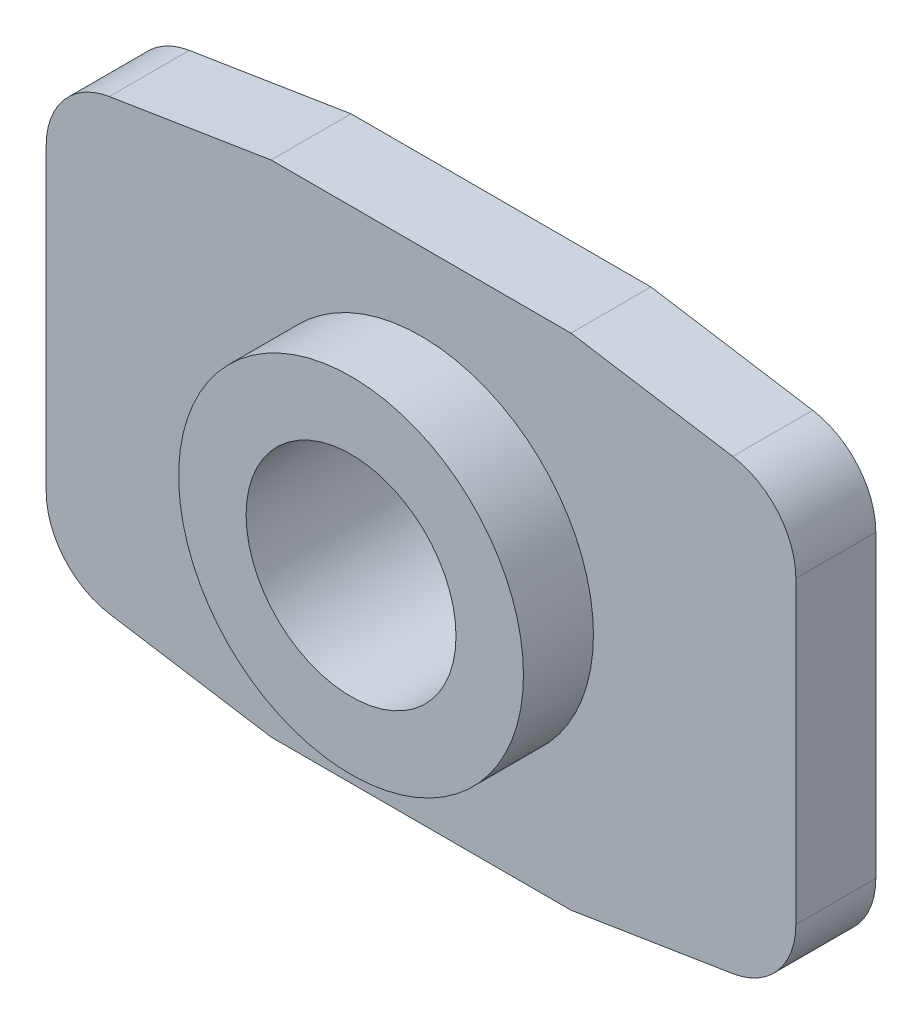
ISO-10303-21;
HEADER;
FILE_DESCRIPTION(('STEP AP214'),'2;1');
FILE_NAME('part.step','',(''),(''),'','','');
FILE_SCHEMA(('AUTOMOTIVE_DESIGN { 1 0 10303 214 1 1 1 1 }'));
ENDSEC;
DATA;
#1=APPLICATION_CONTEXT('core data for automotive mechanical design processes');
#2=APPLICATION_PROTOCOL_DEFINITION('international standard','automotive_design',2000,#1);
#3=PRODUCT_CONTEXT('',#1,'mechanical');
#4=PRODUCT('Part','Part','',(#3));
#5=PRODUCT_RELATED_PRODUCT_CATEGORY('part','',(#4));
#6=PRODUCT_DEFINITION_FORMATION('','',#4);
#7=PRODUCT_DEFINITION_CONTEXT('part definition',#1,'design');
#8=PRODUCT_DEFINITION('design','',#6,#7);
#9=PRODUCT_DEFINITION_SHAPE('','',#8);
#10=(LENGTH_UNIT() NAMED_UNIT(*) SI_UNIT(.MILLI.,.METRE.));
#11=(NAMED_UNIT(*) PLANE_ANGLE_UNIT() SI_UNIT($,.RADIAN.));
#12=(NAMED_UNIT(*) SI_UNIT($,.STERADIAN.) SOLID_ANGLE_UNIT());
#13=UNCERTAINTY_MEASURE_WITH_UNIT(LENGTH_MEASURE(1.E-05),#10,'distance_accuracy_value','');
#14=(GEOMETRIC_REPRESENTATION_CONTEXT(3) GLOBAL_UNCERTAINTY_ASSIGNED_CONTEXT((#13)) GLOBAL_UNIT_ASSIGNED_CONTEXT((#10,
#11,#12)) REPRESENTATION_CONTEXT('',''));
#15=CARTESIAN_POINT('',(0.,0.,0.));
#16=DIRECTION('',(0.,0.,1.));
#17=DIRECTION('',(1.,0.,0.));
#18=AXIS2_PLACEMENT_3D('',#15,#16,#17);
#19=CARTESIAN_POINT('',(6.,3.,1.6));
#20=DIRECTION('',(0.,0.,1.));
#21=DIRECTION('',(1.,0.,0.));
#22=AXIS2_PLACEMENT_3D('',#19,#20,#21);
#23=PLANE('',#22);
#24=CARTESIAN_POINT('',(6.,3.,1.6));
#25=DIRECTION('',(0.,0.,1.));
#26=DIRECTION('',(1.,0.,0.));
#27=AXIS2_PLACEMENT_3D('',#24,#25,#26);
#28=CIRCLE('',#27,1.5);
#29=CARTESIAN_POINT('',(7.5,3.,1.6));
#30=VERTEX_POINT('',#29);
#31=CARTESIAN_POINT('',(6.23739675280407,4.48109512920611,1.6));
#32=VERTEX_POINT('',#31);
#33=EDGE_CURVE('E179',#30,#32,#28,.T.);
#34=ORIENTED_EDGE('',*,*,#33,.T.);
#35=DIRECTION('',(-0.987396752804077,0.158264501869385,0.));
#36=VECTOR('',#35,1.);
#37=CARTESIAN_POINT('',(6.23739675280407,4.48109512920611,1.6));
#38=LINE('',#37,#36);
#39=CARTESIAN_POINT('',(3.,5.,1.6));
#40=VERTEX_POINT('',#39);
#41=EDGE_CURVE('E107',#32,#40,#38,.T.);
#42=ORIENTED_EDGE('',*,*,#41,.T.);
#43=DIRECTION('',(-1.,0.,0.));
#44=VECTOR('',#43,1.);
#45=CARTESIAN_POINT('',(-3.,5.,1.6));
#46=LINE('',#45,#44);
#47=CARTESIAN_POINT('',(-3.,5.,1.6));
#48=VERTEX_POINT('',#47);
#49=EDGE_CURVE('E206',#40,#48,#46,.T.);
#50=ORIENTED_EDGE('',*,*,#49,.T.);
#51=DIRECTION('',(-0.987396752804077,-0.158264501869386,0.));
#52=VECTOR('',#51,1.);
#53=CARTESIAN_POINT('',(-6.23739675280407,4.48109512920611,1.6));
#54=LINE('',#53,#52);
#55=CARTESIAN_POINT('',(-6.23739675280407,4.48109512920611,1.6));
#56=VERTEX_POINT('',#55);
#57=EDGE_CURVE('E224',#48,#56,#54,.T.);
#58=ORIENTED_EDGE('',*,*,#57,.T.);
#59=CARTESIAN_POINT('',(-6.,3.,1.6));
#60=DIRECTION('',(0.,0.,1.));
#61=DIRECTION('',(-1.,0.,0.));
#62=AXIS2_PLACEMENT_3D('',#59,#60,#61);
#63=CIRCLE('',#62,1.5);
#64=CARTESIAN_POINT('',(-7.5,3.,1.6));
#65=VERTEX_POINT('',#64);
#66=EDGE_CURVE('E221',#56,#65,#63,.T.);
#67=ORIENTED_EDGE('',*,*,#66,.T.);
#68=DIRECTION('',(0.,-1.,0.));
#69=VECTOR('',#68,1.);
#70=CARTESIAN_POINT('',(-7.5,-3.,1.6));
#71=LINE('',#70,#69);
#72=CARTESIAN_POINT('',(-7.5,-3.,1.6));
#73=VERTEX_POINT('',#72);
#74=EDGE_CURVE('E223',#65,#73,#71,.T.);
#75=ORIENTED_EDGE('',*,*,#74,.T.);
#76=CARTESIAN_POINT('',(-6.,-3.,1.6));
#77=DIRECTION('',(0.,0.,1.));
#78=DIRECTION('',(1.,0.,0.));
#79=AXIS2_PLACEMENT_3D('',#76,#77,#78);
#80=CIRCLE('',#79,1.5);
#81=CARTESIAN_POINT('',(-6.23739675280407,-4.48109512920612,1.6));
#82=VERTEX_POINT('',#81);
#83=EDGE_CURVE('E226',#73,#82,#80,.T.);
#84=ORIENTED_EDGE('',*,*,#83,.T.);
#85=DIRECTION('',(0.987396752804077,-0.158264501869385,0.));
#86=VECTOR('',#85,1.);
#87=CARTESIAN_POINT('',(-6.23739675280407,-4.48109512920612,1.6));
#88=LINE('',#87,#86);
#89=CARTESIAN_POINT('',(-3.,-5.,1.6));
#90=VERTEX_POINT('',#89);
#91=EDGE_CURVE('E232',#82,#90,#88,.T.);
#92=ORIENTED_EDGE('',*,*,#91,.T.);
#93=DIRECTION('',(1.,0.,0.));
#94=VECTOR('',#93,1.);
#95=CARTESIAN_POINT('',(-3.,-5.,1.6));
#96=LINE('',#95,#94);
#97=CARTESIAN_POINT('',(3.,-5.,1.6));
#98=VERTEX_POINT('',#97);
#99=EDGE_CURVE('E138',#90,#98,#96,.T.);
#100=ORIENTED_EDGE('',*,*,#99,.T.);
#101=DIRECTION('',(0.987396752804077,0.158264501869385,0.));
#102=VECTOR('',#101,1.);
#103=CARTESIAN_POINT('',(6.23739675280407,-4.48109512920611,1.6));
#104=LINE('',#103,#102);
#105=CARTESIAN_POINT('',(6.23739675280407,-4.48109512920612,1.6));
#106=VERTEX_POINT('',#105);
#107=EDGE_CURVE('E132',#98,#106,#104,.T.);
#108=ORIENTED_EDGE('',*,*,#107,.T.);
#109=CARTESIAN_POINT('',(6.,-3.,1.6));
#110=DIRECTION('',(0.,0.,1.));
#111=DIRECTION('',(-1.,0.,0.));
#112=AXIS2_PLACEMENT_3D('',#109,#110,#111);
#113=CIRCLE('',#112,1.5);
#114=CARTESIAN_POINT('',(7.5,-3.,1.6));
#115=VERTEX_POINT('',#114);
#116=EDGE_CURVE('E136',#106,#115,#113,.T.);
#117=ORIENTED_EDGE('',*,*,#116,.T.);
#118=DIRECTION('',(0.,1.,0.));
#119=VECTOR('',#118,1.);
#120=CARTESIAN_POINT('',(7.5,-3.,1.6));
#121=LINE('',#120,#119);
#122=EDGE_CURVE('E52',#115,#30,#121,.T.);
#123=ORIENTED_EDGE('',*,*,#122,.T.);
#124=EDGE_LOOP('',(#34,#42,#50,#58,#67,#75,#84,#92,#100,#108,#117,#123));
#125=FACE_BOUND('',#124,.T.);
#126=CARTESIAN_POINT('',(0.,0.,1.6));
#127=DIRECTION('',(0.,0.,1.));
#128=DIRECTION('',(1.,0.,0.));
#129=AXIS2_PLACEMENT_3D('',#126,#127,#128);
#130=CIRCLE('',#129,3.45);
#131=CARTESIAN_POINT('',(3.45,0.,1.6));
#132=VERTEX_POINT('',#131);
#133=EDGE_CURVE('E284',#132,#132,#130,.T.);
#134=ORIENTED_EDGE('',*,*,#133,.F.);
#135=EDGE_LOOP('',(#134));
#136=FACE_BOUND('',#135,.T.);
#137=ADVANCED_FACE('F35',(#125,#136),#23,.T.);
#138=CARTESIAN_POINT('',(6.,3.,1.6));
#139=DIRECTION('',(0.,0.,-1.));
#140=DIRECTION('',(-1.,0.,0.));
#141=AXIS2_PLACEMENT_3D('',#138,#139,#140);
#142=CYLINDRICAL_SURFACE('',#141,1.5);
#143=CARTESIAN_POINT('',(6.,3.,0.));
#144=DIRECTION('',(0.,0.,1.));
#145=DIRECTION('',(1.,0.,0.));
#146=AXIS2_PLACEMENT_3D('',#143,#144,#145);
#147=CIRCLE('',#146,1.5);
#148=CARTESIAN_POINT('',(7.5,3.,0.));
#149=VERTEX_POINT('',#148);
#150=CARTESIAN_POINT('',(6.23739675280407,4.48109512920611,0.));
#151=VERTEX_POINT('',#150);
#152=EDGE_CURVE('E156',#149,#151,#147,.T.);
#153=ORIENTED_EDGE('',*,*,#152,.T.);
#154=DIRECTION('',(0.,0.,-1.));
#155=VECTOR('',#154,1.);
#156=CARTESIAN_POINT('',(6.23739675280407,4.48109512920611,1.6));
#157=LINE('',#156,#155);
#158=EDGE_CURVE('E11',#32,#151,#157,.T.);
#159=ORIENTED_EDGE('',*,*,#158,.F.);
#160=ORIENTED_EDGE('',*,*,#33,.F.);
#161=DIRECTION('',(0.,0.,-1.));
#162=VECTOR('',#161,1.);
#163=CARTESIAN_POINT('',(7.5,3.,1.6));
#164=LINE('',#163,#162);
#165=EDGE_CURVE('E152',#30,#149,#164,.T.);
#166=ORIENTED_EDGE('',*,*,#165,.T.);
#167=EDGE_LOOP('',(#153,#159,#160,#166));
#168=FACE_BOUND('',#167,.T.);
#169=ADVANCED_FACE('F37',(#168),#142,.T.);
#170=CARTESIAN_POINT('',(6.23739675280407,4.48109512920611,1.6));
#171=DIRECTION('',(-0.158264501869385,-0.987396752804077,0.));
#172=DIRECTION('',(0.987396752804077,-0.158264501869385,0.));
#173=AXIS2_PLACEMENT_3D('',#170,#171,#172);
#174=PLANE('',#173);
#175=DIRECTION('',(-0.987396752804077,0.158264501869385,0.));
#176=VECTOR('',#175,1.);
#177=CARTESIAN_POINT('',(6.23739675280407,4.48109512920611,0.));
#178=LINE('',#177,#176);
#179=CARTESIAN_POINT('',(3.,5.,0.));
#180=VERTEX_POINT('',#179);
#181=EDGE_CURVE('E159',#151,#180,#178,.T.);
#182=ORIENTED_EDGE('',*,*,#181,.T.);
#183=DIRECTION('',(0.,0.,-1.));
#184=VECTOR('',#183,1.);
#185=CARTESIAN_POINT('',(3.,5.,1.6));
#186=LINE('',#185,#184);
#187=EDGE_CURVE('E44',#40,#180,#186,.T.);
#188=ORIENTED_EDGE('',*,*,#187,.F.);
#189=ORIENTED_EDGE('',*,*,#41,.F.);
#190=ORIENTED_EDGE('',*,*,#158,.T.);
#191=EDGE_LOOP('',(#182,#188,#189,#190));
#192=FACE_BOUND('',#191,.T.);
#193=ADVANCED_FACE('F262',(#192),#174,.F.);
#194=CARTESIAN_POINT('',(-3.,5.,1.6));
#195=DIRECTION('',(0.,-1.,0.));
#196=DIRECTION('',(0.,0.,-1.));
#197=AXIS2_PLACEMENT_3D('',#194,#195,#196);
#198=PLANE('',#197);
#199=DIRECTION('',(-1.,0.,0.));
#200=VECTOR('',#199,1.);
#201=CARTESIAN_POINT('',(-3.,5.,0.));
#202=LINE('',#201,#200);
#203=CARTESIAN_POINT('',(-3.,5.,0.));
#204=VERTEX_POINT('',#203);
#205=EDGE_CURVE('E162',#180,#204,#202,.T.);
#206=ORIENTED_EDGE('',*,*,#205,.T.);
#207=DIRECTION('',(0.,0.,-1.));
#208=VECTOR('',#207,1.);
#209=CARTESIAN_POINT('',(-3.,5.,1.6));
#210=LINE('',#209,#208);
#211=EDGE_CURVE('E198',#48,#204,#210,.T.);
#212=ORIENTED_EDGE('',*,*,#211,.F.);
#213=ORIENTED_EDGE('',*,*,#49,.F.);
#214=ORIENTED_EDGE('',*,*,#187,.T.);
#215=EDGE_LOOP('',(#206,#212,#213,#214));
#216=FACE_BOUND('',#215,.T.);
#217=ADVANCED_FACE('F204',(#216),#198,.F.);
#218=CARTESIAN_POINT('',(-6.23739675280407,4.48109512920611,1.6));
#219=DIRECTION('',(0.158264501869386,-0.987396752804077,0.));
#220=DIRECTION('',(0.987396752804077,0.158264501869386,0.));
#221=AXIS2_PLACEMENT_3D('',#218,#219,#220);
#222=PLANE('',#221);
#223=DIRECTION('',(-0.987396752804077,-0.158264501869386,0.));
#224=VECTOR('',#223,1.);
#225=CARTESIAN_POINT('',(-6.23739675280407,4.48109512920611,0.));
#226=LINE('',#225,#224);
#227=CARTESIAN_POINT('',(-6.23739675280407,4.48109512920611,0.));
#228=VERTEX_POINT('',#227);
#229=EDGE_CURVE('E164',#204,#228,#226,.T.);
#230=ORIENTED_EDGE('',*,*,#229,.T.);
#231=DIRECTION('',(0.,0.,-1.));
#232=VECTOR('',#231,1.);
#233=CARTESIAN_POINT('',(-6.23739675280407,4.48109512920611,1.6));
#234=LINE('',#233,#232);
#235=EDGE_CURVE('E195',#56,#228,#234,.T.);
#236=ORIENTED_EDGE('',*,*,#235,.F.);
#237=ORIENTED_EDGE('',*,*,#57,.F.);
#238=ORIENTED_EDGE('',*,*,#211,.T.);
#239=EDGE_LOOP('',(#230,#236,#237,#238));
#240=FACE_BOUND('',#239,.T.);
#241=ADVANCED_FACE('F215',(#240),#222,.F.);
#242=CARTESIAN_POINT('',(-6.,3.,1.6));
#243=DIRECTION('',(0.,0.,-1.));
#244=DIRECTION('',(-1.,0.,0.));
#245=AXIS2_PLACEMENT_3D('',#242,#243,#244);
#246=CYLINDRICAL_SURFACE('',#245,1.5);
#247=CARTESIAN_POINT('',(-6.,3.,0.));
#248=DIRECTION('',(0.,0.,1.));
#249=DIRECTION('',(-1.,0.,0.));
#250=AXIS2_PLACEMENT_3D('',#247,#248,#249);
#251=CIRCLE('',#250,1.5);
#252=CARTESIAN_POINT('',(-7.5,3.,0.));
#253=VERTEX_POINT('',#252);
#254=EDGE_CURVE('E166',#228,#253,#251,.T.);
#255=ORIENTED_EDGE('',*,*,#254,.T.);
#256=DIRECTION('',(0.,0.,-1.));
#257=VECTOR('',#256,1.);
#258=CARTESIAN_POINT('',(-7.5,3.,1.6));
#259=LINE('',#258,#257);
#260=EDGE_CURVE('E192',#65,#253,#259,.T.);
#261=ORIENTED_EDGE('',*,*,#260,.F.);
#262=ORIENTED_EDGE('',*,*,#66,.F.);
#263=ORIENTED_EDGE('',*,*,#235,.T.);
#264=EDGE_LOOP('',(#255,#261,#262,#263));
#265=FACE_BOUND('',#264,.T.);
#266=ADVANCED_FACE('F219',(#265),#246,.T.);
#267=CARTESIAN_POINT('',(-7.5,-3.,1.6));
#268=DIRECTION('',(1.,0.,0.));
#269=DIRECTION('',(0.,0.,-1.));
#270=AXIS2_PLACEMENT_3D('',#267,#268,#269);
#271=PLANE('',#270);
#272=DIRECTION('',(0.,-1.,0.));
#273=VECTOR('',#272,1.);
#274=CARTESIAN_POINT('',(-7.5,-3.,0.));
#275=LINE('',#274,#273);
#276=CARTESIAN_POINT('',(-7.5,-3.,0.));
#277=VERTEX_POINT('',#276);
#278=EDGE_CURVE('E168',#253,#277,#275,.T.);
#279=ORIENTED_EDGE('',*,*,#278,.T.);
#280=DIRECTION('',(0.,0.,-1.));
#281=VECTOR('',#280,1.);
#282=CARTESIAN_POINT('',(-7.5,-3.,1.6));
#283=LINE('',#282,#281);
#284=EDGE_CURVE('E189',#73,#277,#283,.T.);
#285=ORIENTED_EDGE('',*,*,#284,.F.);
#286=ORIENTED_EDGE('',*,*,#74,.F.);
#287=ORIENTED_EDGE('',*,*,#260,.T.);
#288=EDGE_LOOP('',(#279,#285,#286,#287));
#289=FACE_BOUND('',#288,.T.);
#290=ADVANCED_FACE('F362',(#289),#271,.F.);
#291=CARTESIAN_POINT('',(-6.,-3.,1.6));
#292=DIRECTION('',(0.,0.,-1.));
#293=DIRECTION('',(-1.,0.,0.));
#294=AXIS2_PLACEMENT_3D('',#291,#292,#293);
#295=CYLINDRICAL_SURFACE('',#294,1.5);
#296=CARTESIAN_POINT('',(-6.,-3.,0.));
#297=DIRECTION('',(0.,0.,1.));
#298=DIRECTION('',(1.,0.,0.));
#299=AXIS2_PLACEMENT_3D('',#296,#297,#298);
#300=CIRCLE('',#299,1.5);
#301=CARTESIAN_POINT('',(-6.23739675280407,-4.48109512920612,0.));
#302=VERTEX_POINT('',#301);
#303=EDGE_CURVE('E170',#277,#302,#300,.T.);
#304=ORIENTED_EDGE('',*,*,#303,.T.);
#305=DIRECTION('',(0.,0.,-1.));
#306=VECTOR('',#305,1.);
#307=CARTESIAN_POINT('',(-6.23739675280407,-4.48109512920612,1.6));
#308=LINE('',#307,#306);
#309=EDGE_CURVE('E186',#82,#302,#308,.T.);
#310=ORIENTED_EDGE('',*,*,#309,.F.);
#311=ORIENTED_EDGE('',*,*,#83,.F.);
#312=ORIENTED_EDGE('',*,*,#284,.T.);
#313=EDGE_LOOP('',(#304,#310,#311,#312));
#314=FACE_BOUND('',#313,.T.);
#315=ADVANCED_FACE('F353',(#314),#295,.T.);
#316=CARTESIAN_POINT('',(-6.23739675280407,-4.48109512920612,1.6));
#317=DIRECTION('',(0.158264501869385,0.987396752804077,0.));
#318=DIRECTION('',(-0.987396752804077,0.158264501869385,0.));
#319=AXIS2_PLACEMENT_3D('',#316,#317,#318);
#320=PLANE('',#319);
#321=DIRECTION('',(0.987396752804077,-0.158264501869385,0.));
#322=VECTOR('',#321,1.);
#323=CARTESIAN_POINT('',(-6.23739675280407,-4.48109512920612,0.));
#324=LINE('',#323,#322);
#325=CARTESIAN_POINT('',(-3.,-5.,0.));
#326=VERTEX_POINT('',#325);
#327=EDGE_CURVE('E172',#302,#326,#324,.T.);
#328=ORIENTED_EDGE('',*,*,#327,.T.);
#329=DIRECTION('',(0.,0.,-1.));
#330=VECTOR('',#329,1.);
#331=CARTESIAN_POINT('',(-3.,-5.,1.6));
#332=LINE('',#331,#330);
#333=EDGE_CURVE('E183',#90,#326,#332,.T.);
#334=ORIENTED_EDGE('',*,*,#333,.F.);
#335=ORIENTED_EDGE('',*,*,#91,.F.);
#336=ORIENTED_EDGE('',*,*,#309,.T.);
#337=EDGE_LOOP('',(#328,#334,#335,#336));
#338=FACE_BOUND('',#337,.T.);
#339=ADVANCED_FACE('F238',(#338),#320,.F.);
#340=CARTESIAN_POINT('',(-3.,-5.,1.6));
#341=DIRECTION('',(0.,1.,0.));
#342=DIRECTION('',(0.,0.,1.));
#343=AXIS2_PLACEMENT_3D('',#340,#341,#342);
#344=PLANE('',#343);
#345=DIRECTION('',(1.,0.,0.));
#346=VECTOR('',#345,1.);
#347=CARTESIAN_POINT('',(-3.,-5.,0.));
#348=LINE('',#347,#346);
#349=CARTESIAN_POINT('',(3.,-5.,0.));
#350=VERTEX_POINT('',#349);
#351=EDGE_CURVE('E174',#326,#350,#348,.T.);
#352=ORIENTED_EDGE('',*,*,#351,.T.);
#353=DIRECTION('',(0.,0.,-1.));
#354=VECTOR('',#353,1.);
#355=CARTESIAN_POINT('',(3.,-5.,1.6));
#356=LINE('',#355,#354);
#357=EDGE_CURVE('E147',#98,#350,#356,.T.);
#358=ORIENTED_EDGE('',*,*,#357,.F.);
#359=ORIENTED_EDGE('',*,*,#99,.F.);
#360=ORIENTED_EDGE('',*,*,#333,.T.);
#361=EDGE_LOOP('',(#352,#358,#359,#360));
#362=FACE_BOUND('',#361,.T.);
#363=ADVANCED_FACE('F242',(#362),#344,.F.);
#364=CARTESIAN_POINT('',(6.23739675280407,-4.48109512920611,1.6));
#365=DIRECTION('',(-0.158264501869385,0.987396752804077,0.));
#366=DIRECTION('',(-0.987396752804077,-0.158264501869385,0.));
#367=AXIS2_PLACEMENT_3D('',#364,#365,#366);
#368=PLANE('',#367);
#369=DIRECTION('',(0.987396752804077,0.158264501869385,0.));
#370=VECTOR('',#369,1.);
#371=CARTESIAN_POINT('',(6.23739675280407,-4.48109512920611,0.));
#372=LINE('',#371,#370);
#373=CARTESIAN_POINT('',(6.23739675280407,-4.48109512920612,0.));
#374=VERTEX_POINT('',#373);
#375=EDGE_CURVE('E146',#350,#374,#372,.T.);
#376=ORIENTED_EDGE('',*,*,#375,.T.);
#377=DIRECTION('',(0.,0.,-1.));
#378=VECTOR('',#377,1.);
#379=CARTESIAN_POINT('',(6.23739675280407,-4.48109512920612,1.6));
#380=LINE('',#379,#378);
#381=EDGE_CURVE('E143',#106,#374,#380,.T.);
#382=ORIENTED_EDGE('',*,*,#381,.F.);
#383=ORIENTED_EDGE('',*,*,#107,.F.);
#384=ORIENTED_EDGE('',*,*,#357,.T.);
#385=EDGE_LOOP('',(#376,#382,#383,#384));
#386=FACE_BOUND('',#385,.T.);
#387=ADVANCED_FACE('F144',(#386),#368,.F.);
#388=CARTESIAN_POINT('',(6.,-3.,1.6));
#389=DIRECTION('',(0.,0.,-1.));
#390=DIRECTION('',(-1.,0.,0.));
#391=AXIS2_PLACEMENT_3D('',#388,#389,#390);
#392=CYLINDRICAL_SURFACE('',#391,1.5);
#393=CARTESIAN_POINT('',(6.,-3.,0.));
#394=DIRECTION('',(0.,0.,1.));
#395=DIRECTION('',(-1.,0.,0.));
#396=AXIS2_PLACEMENT_3D('',#393,#394,#395);
#397=CIRCLE('',#396,1.5);
#398=CARTESIAN_POINT('',(7.5,-3.,0.));
#399=VERTEX_POINT('',#398);
#400=EDGE_CURVE('E93',#374,#399,#397,.T.);
#401=ORIENTED_EDGE('',*,*,#400,.T.);
#402=DIRECTION('',(0.,0.,-1.));
#403=VECTOR('',#402,1.);
#404=CARTESIAN_POINT('',(7.5,-3.,1.6));
#405=LINE('',#404,#403);
#406=EDGE_CURVE('E148',#115,#399,#405,.T.);
#407=ORIENTED_EDGE('',*,*,#406,.F.);
#408=ORIENTED_EDGE('',*,*,#116,.F.);
#409=ORIENTED_EDGE('',*,*,#381,.T.);
#410=EDGE_LOOP('',(#401,#407,#408,#409));
#411=FACE_BOUND('',#410,.T.);
#412=ADVANCED_FACE('F150',(#411),#392,.T.);
#413=CARTESIAN_POINT('',(7.5,-3.,1.6));
#414=DIRECTION('',(-1.,0.,0.));
#415=DIRECTION('',(0.,-1.,0.));
#416=AXIS2_PLACEMENT_3D('',#413,#414,#415);
#417=PLANE('',#416);
#418=DIRECTION('',(0.,1.,0.));
#419=VECTOR('',#418,1.);
#420=CARTESIAN_POINT('',(7.5,-3.,0.));
#421=LINE('',#420,#419);
#422=EDGE_CURVE('E99',#399,#149,#421,.T.);
#423=ORIENTED_EDGE('',*,*,#422,.T.);
#424=ORIENTED_EDGE('',*,*,#165,.F.);
#425=ORIENTED_EDGE('',*,*,#122,.F.);
#426=ORIENTED_EDGE('',*,*,#406,.T.);
#427=EDGE_LOOP('',(#423,#424,#425,#426));
#428=FACE_BOUND('',#427,.T.);
#429=ADVANCED_FACE('F246',(#428),#417,.F.);
#430=CARTESIAN_POINT('',(6.,3.,0.));
#431=DIRECTION('',(0.,0.,1.));
#432=DIRECTION('',(1.,0.,0.));
#433=AXIS2_PLACEMENT_3D('',#430,#431,#432);
#434=PLANE('',#433);
#435=CARTESIAN_POINT('',(0.,0.,0.));
#436=DIRECTION('',(0.,0.,1.));
#437=DIRECTION('',(1.,0.,0.));
#438=AXIS2_PLACEMENT_3D('',#435,#436,#437);
#439=CIRCLE('',#438,2.1);
#440=CARTESIAN_POINT('',(2.1,0.,0.));
#441=VERTEX_POINT('',#440);
#442=EDGE_CURVE('E279',#441,#441,#439,.T.);
#443=ORIENTED_EDGE('',*,*,#442,.T.);
#444=EDGE_LOOP('',(#443));
#445=FACE_BOUND('',#444,.T.);
#446=ORIENTED_EDGE('',*,*,#152,.F.);
#447=ORIENTED_EDGE('',*,*,#422,.F.);
#448=ORIENTED_EDGE('',*,*,#400,.F.);
#449=ORIENTED_EDGE('',*,*,#375,.F.);
#450=ORIENTED_EDGE('',*,*,#351,.F.);
#451=ORIENTED_EDGE('',*,*,#327,.F.);
#452=ORIENTED_EDGE('',*,*,#303,.F.);
#453=ORIENTED_EDGE('',*,*,#278,.F.);
#454=ORIENTED_EDGE('',*,*,#254,.F.);
#455=ORIENTED_EDGE('',*,*,#229,.F.);
#456=ORIENTED_EDGE('',*,*,#205,.F.);
#457=ORIENTED_EDGE('',*,*,#181,.F.);
#458=EDGE_LOOP('',(#446,#447,#448,#449,#450,#451,#452,#453,#454,#455,#456,#457));
#459=FACE_BOUND('',#458,.T.);
#460=ADVANCED_FACE('F210',(#445,#459),#434,.F.);
#461=CARTESIAN_POINT('',(0.,0.,3.));
#462=DIRECTION('',(0.,0.,-1.));
#463=DIRECTION('',(-1.,0.,0.));
#464=AXIS2_PLACEMENT_3D('',#461,#462,#463);
#465=CYLINDRICAL_SURFACE('',#464,3.45);
#466=CARTESIAN_POINT('',(0.,0.,3.));
#467=DIRECTION('',(0.,0.,1.));
#468=DIRECTION('',(1.,0.,0.));
#469=AXIS2_PLACEMENT_3D('',#466,#467,#468);
#470=CIRCLE('',#469,3.45);
#471=CARTESIAN_POINT('',(3.45,0.,3.));
#472=VERTEX_POINT('',#471);
#473=EDGE_CURVE('E160',#472,#472,#470,.T.);
#474=ORIENTED_EDGE('',*,*,#473,.F.);
#475=EDGE_LOOP('',(#474));
#476=FACE_BOUND('',#475,.T.);
#477=ORIENTED_EDGE('',*,*,#133,.T.);
#478=EDGE_LOOP('',(#477));
#479=FACE_BOUND('',#478,.T.);
#480=ADVANCED_FACE('F253',(#476,#479),#465,.T.);
#481=CARTESIAN_POINT('',(0.,0.,3.));
#482=DIRECTION('',(0.,0.,1.));
#483=DIRECTION('',(1.,0.,0.));
#484=AXIS2_PLACEMENT_3D('',#481,#482,#483);
#485=PLANE('',#484);
#486=CARTESIAN_POINT('',(0.,0.,3.));
#487=DIRECTION('',(0.,0.,1.));
#488=DIRECTION('',(1.,0.,0.));
#489=AXIS2_PLACEMENT_3D('',#486,#487,#488);
#490=CIRCLE('',#489,2.09999999999999);
#491=CARTESIAN_POINT('',(2.09999999999999,0.,3.));
#492=VERTEX_POINT('',#491);
#493=EDGE_CURVE('E282',#492,#492,#490,.T.);
#494=ORIENTED_EDGE('',*,*,#493,.F.);
#495=EDGE_LOOP('',(#494));
#496=FACE_BOUND('',#495,.T.);
#497=ORIENTED_EDGE('',*,*,#473,.T.);
#498=EDGE_LOOP('',(#497));
#499=FACE_BOUND('',#498,.T.);
#500=ADVANCED_FACE('F266',(#496,#499),#485,.T.);
#501=CARTESIAN_POINT('',(0.,0.,3.));
#502=DIRECTION('',(0.,0.,1.));
#503=DIRECTION('',(1.,0.,0.));
#504=AXIS2_PLACEMENT_3D('',#501,#502,#503);
#505=CYLINDRICAL_SURFACE('',#504,2.09999999999999);
#506=ORIENTED_EDGE('',*,*,#442,.F.);
#507=EDGE_LOOP('',(#506));
#508=FACE_BOUND('',#507,.T.);
#509=ORIENTED_EDGE('',*,*,#493,.T.);
#510=EDGE_LOOP('',(#509));
#511=FACE_BOUND('',#510,.T.);
#512=ADVANCED_FACE('F270',(#508,#511),#505,.F.);
#513=CLOSED_SHELL('',(#137,#169,#193,#217,#241,#266,#290,#315,#339,#363,#387,#412,#429,#460,
#480,#500,#512));
#514=MANIFOLD_SOLID_BREP('B2',#513);
#515=ADVANCED_BREP_SHAPE_REPRESENTATION('',(#18,#514),#14);
#516=SHAPE_DEFINITION_REPRESENTATION(#9,#515);
ENDSEC;
END-ISO-10303-21;
